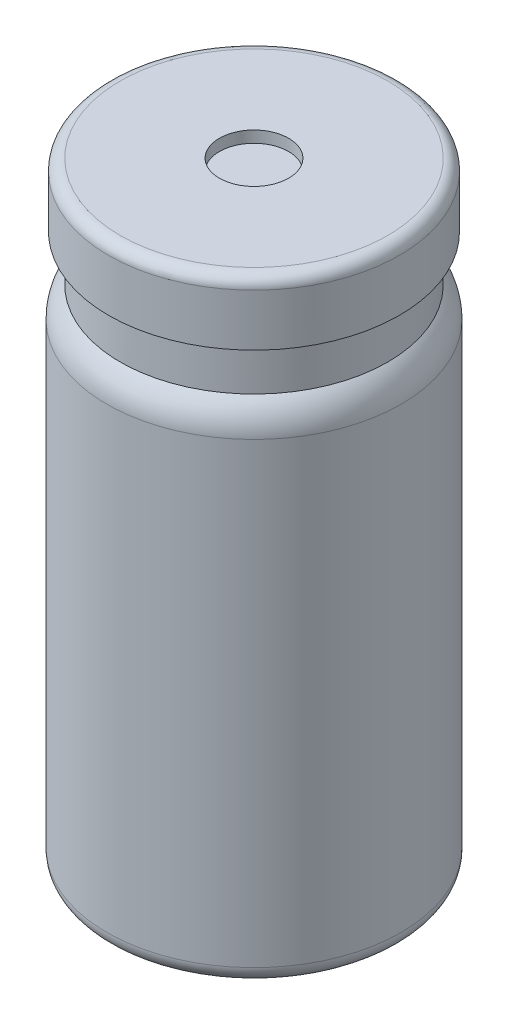
ISO-10303-21;
HEADER;
FILE_DESCRIPTION(('STEP AP214'),'2;1');
FILE_NAME('part.step','',(''),(''),'','','');
FILE_SCHEMA(('AUTOMOTIVE_DESIGN { 1 0 10303 214 1 1 1 1 }'));
ENDSEC;
DATA;
#1=APPLICATION_CONTEXT('core data for automotive mechanical design processes');
#2=APPLICATION_PROTOCOL_DEFINITION('international standard','automotive_design',2000,#1);
#3=PRODUCT_CONTEXT('',#1,'mechanical');
#4=PRODUCT('Part','Part','',(#3));
#5=PRODUCT_RELATED_PRODUCT_CATEGORY('part','',(#4));
#6=PRODUCT_DEFINITION_FORMATION('','',#4);
#7=PRODUCT_DEFINITION_CONTEXT('part definition',#1,'design');
#8=PRODUCT_DEFINITION('design','',#6,#7);
#9=PRODUCT_DEFINITION_SHAPE('','',#8);
#10=(LENGTH_UNIT() NAMED_UNIT(*) SI_UNIT(.MILLI.,.METRE.));
#11=(NAMED_UNIT(*) PLANE_ANGLE_UNIT() SI_UNIT($,.RADIAN.));
#12=(NAMED_UNIT(*) SI_UNIT($,.STERADIAN.) SOLID_ANGLE_UNIT());
#13=UNCERTAINTY_MEASURE_WITH_UNIT(LENGTH_MEASURE(1.E-05),#10,'distance_accuracy_value','');
#14=(GEOMETRIC_REPRESENTATION_CONTEXT(3) GLOBAL_UNCERTAINTY_ASSIGNED_CONTEXT((#13)) GLOBAL_UNIT_ASSIGNED_CONTEXT((#10,
#11,#12)) REPRESENTATION_CONTEXT('',''));
#15=CARTESIAN_POINT('',(0.,0.,0.));
#16=DIRECTION('',(0.,0.,1.));
#17=DIRECTION('',(1.,0.,0.));
#18=AXIS2_PLACEMENT_3D('',#15,#16,#17);
#19=CARTESIAN_POINT('',(0.,51.23,0.));
#20=DIRECTION('',(0.,1.,0.));
#21=DIRECTION('',(-1.,0.,0.));
#22=AXIS2_PLACEMENT_3D('',#19,#20,#21);
#23=CYLINDRICAL_SURFACE('',#22,11.595);
#24=CARTESIAN_POINT('',(0.,43.73,0.));
#25=DIRECTION('',(0.,1.,0.));
#26=DIRECTION('',(-1.,0.,0.));
#27=AXIS2_PLACEMENT_3D('',#24,#25,#26);
#28=CIRCLE('',#27,11.595);
#29=CARTESIAN_POINT('',(-11.595,43.73,0.));
#30=VERTEX_POINT('',#29);
#31=EDGE_CURVE('E73',#30,#30,#28,.T.);
#32=ORIENTED_EDGE('',*,*,#31,.T.);
#33=EDGE_LOOP('',(#32));
#34=FACE_BOUND('',#33,.T.);
#35=CARTESIAN_POINT('',(0.,47.73,0.));
#36=DIRECTION('',(0.,1.,0.));
#37=DIRECTION('',(0.,0.,1.));
#38=AXIS2_PLACEMENT_3D('',#35,#36,#37);
#39=CIRCLE('',#38,11.595);
#40=CARTESIAN_POINT('',(0.,47.73,11.595));
#41=VERTEX_POINT('',#40);
#42=EDGE_CURVE('E89',#41,#41,#39,.T.);
#43=ORIENTED_EDGE('',*,*,#42,.F.);
#44=EDGE_LOOP('',(#43));
#45=FACE_BOUND('',#44,.T.);
#46=ADVANCED_FACE('F45',(#34,#45),#23,.T.);
#47=CARTESIAN_POINT('',(0.,0.,0.));
#48=DIRECTION('',(0.,-1.,0.));
#49=DIRECTION('',(1.,0.,0.));
#50=AXIS2_PLACEMENT_3D('',#47,#48,#49);
#51=PLANE('',#50);
#52=CARTESIAN_POINT('',(0.,0.,0.));
#53=DIRECTION('',(0.,-1.,0.));
#54=DIRECTION('',(1.,0.,0.));
#55=AXIS2_PLACEMENT_3D('',#52,#53,#54);
#56=CIRCLE('',#55,11.245);
#57=CARTESIAN_POINT('',(11.245,0.,0.));
#58=VERTEX_POINT('',#57);
#59=EDGE_CURVE('E58',#58,#58,#56,.T.);
#60=ORIENTED_EDGE('',*,*,#59,.T.);
#61=EDGE_LOOP('',(#60));
#62=FACE_BOUND('',#61,.T.);
#63=ADVANCED_FACE('F119',(#62),#51,.T.);
#64=CARTESIAN_POINT('',(0.,51.23,0.));
#65=DIRECTION('',(0.,1.,0.));
#66=DIRECTION('',(-1.,0.,0.));
#67=AXIS2_PLACEMENT_3D('',#64,#65,#66);
#68=CYLINDRICAL_SURFACE('',#67,12.745);
#69=CARTESIAN_POINT('',(0.,1.5,0.));
#70=DIRECTION('',(0.,-1.,0.));
#71=DIRECTION('',(1.,0.,0.));
#72=AXIS2_PLACEMENT_3D('',#69,#70,#71);
#73=CIRCLE('',#72,12.745);
#74=CARTESIAN_POINT('',(12.745,1.5,0.));
#75=VERTEX_POINT('',#74);
#76=EDGE_CURVE('E63',#75,#75,#73,.F.);
#77=ORIENTED_EDGE('',*,*,#76,.T.);
#78=EDGE_LOOP('',(#77));
#79=FACE_BOUND('',#78,.T.);
#80=CARTESIAN_POINT('',(0.,41.1362575301314,0.));
#81=DIRECTION('',(0.,1.,0.));
#82=DIRECTION('',(-1.,0.,0.));
#83=AXIS2_PLACEMENT_3D('',#80,#81,#82);
#84=CIRCLE('',#83,12.745);
#85=CARTESIAN_POINT('',(-12.745,41.1362575301314,0.));
#86=VERTEX_POINT('',#85);
#87=EDGE_CURVE('E69',#86,#86,#84,.F.);
#88=ORIENTED_EDGE('',*,*,#87,.T.);
#89=EDGE_LOOP('',(#88));
#90=FACE_BOUND('',#89,.T.);
#91=ADVANCED_FACE('F127',(#79,#90),#68,.T.);
#92=CARTESIAN_POINT('',(0.,41.1362575301314,0.));
#93=DIRECTION('',(0.,1.,0.));
#94=DIRECTION('',(-1.,0.,0.));
#95=AXIS2_PLACEMENT_3D('',#92,#93,#94);
#96=TOROIDAL_SURFACE('',#95,9.24499999999999,3.5);
#97=ORIENTED_EDGE('',*,*,#87,.F.);
#98=EDGE_LOOP('',(#97));
#99=FACE_BOUND('',#98,.T.);
#100=ORIENTED_EDGE('',*,*,#31,.F.);
#101=EDGE_LOOP('',(#100));
#102=FACE_BOUND('',#101,.T.);
#103=ADVANCED_FACE('F134',(#99,#102),#96,.T.);
#104=CARTESIAN_POINT('',(0.,1.5,0.));
#105=DIRECTION('',(0.,-1.,0.));
#106=DIRECTION('',(1.,0.,0.));
#107=AXIS2_PLACEMENT_3D('',#104,#105,#106);
#108=TOROIDAL_SURFACE('',#107,11.245,1.5);
#109=ORIENTED_EDGE('',*,*,#59,.F.);
#110=EDGE_LOOP('',(#109));
#111=FACE_BOUND('',#110,.T.);
#112=ORIENTED_EDGE('',*,*,#76,.F.);
#113=EDGE_LOOP('',(#112));
#114=FACE_BOUND('',#113,.T.);
#115=ADVANCED_FACE('F138',(#111,#114),#108,.T.);
#116=CARTESIAN_POINT('',(0.,51.23,0.));
#117=DIRECTION('',(0.,1.,0.));
#118=DIRECTION('',(0.,0.,1.));
#119=AXIS2_PLACEMENT_3D('',#116,#117,#118);
#120=CYLINDRICAL_SURFACE('',#119,3.);
#121=CARTESIAN_POINT('',(0.,52.23,0.));
#122=DIRECTION('',(0.,1.,0.));
#123=DIRECTION('',(0.,0.,1.));
#124=AXIS2_PLACEMENT_3D('',#121,#122,#123);
#125=CIRCLE('',#124,3.);
#126=CARTESIAN_POINT('',(0.,52.23,3.));
#127=VERTEX_POINT('',#126);
#128=EDGE_CURVE('E81',#127,#127,#125,.T.);
#129=ORIENTED_EDGE('',*,*,#128,.F.);
#130=EDGE_LOOP('',(#129));
#131=FACE_BOUND('',#130,.T.);
#132=CARTESIAN_POINT('',(0.,53.23,0.));
#133=DIRECTION('',(0.,1.,0.));
#134=DIRECTION('',(0.,0.,1.));
#135=AXIS2_PLACEMENT_3D('',#132,#133,#134);
#136=CIRCLE('',#135,3.);
#137=CARTESIAN_POINT('',(0.,53.23,3.));
#138=VERTEX_POINT('',#137);
#139=EDGE_CURVE('E97',#138,#138,#136,.T.);
#140=ORIENTED_EDGE('',*,*,#139,.T.);
#141=EDGE_LOOP('',(#140));
#142=FACE_BOUND('',#141,.T.);
#143=ADVANCED_FACE('F102',(#131,#142),#120,.F.);
#144=CARTESIAN_POINT('',(0.,52.23,-3.));
#145=DIRECTION('',(0.,1.,0.));
#146=DIRECTION('',(0.,0.,1.));
#147=AXIS2_PLACEMENT_3D('',#144,#145,#146);
#148=PLANE('',#147);
#149=CARTESIAN_POINT('',(0.,52.23,0.));
#150=DIRECTION('',(0.,1.,0.));
#151=DIRECTION('',(0.,0.,1.));
#152=AXIS2_PLACEMENT_3D('',#149,#150,#151);
#153=CIRCLE('',#152,11.595);
#154=CARTESIAN_POINT('',(0.,52.23,11.595));
#155=VERTEX_POINT('',#154);
#156=EDGE_CURVE('E85',#155,#155,#153,.T.);
#157=ORIENTED_EDGE('',*,*,#156,.F.);
#158=EDGE_LOOP('',(#157));
#159=FACE_BOUND('',#158,.T.);
#160=ORIENTED_EDGE('',*,*,#128,.T.);
#161=EDGE_LOOP('',(#160));
#162=FACE_BOUND('',#161,.T.);
#163=ADVANCED_FACE('F143',(#159,#162),#148,.F.);
#164=CARTESIAN_POINT('',(0.,51.23,0.));
#165=DIRECTION('',(0.,1.,0.));
#166=DIRECTION('',(0.,0.,1.));
#167=AXIS2_PLACEMENT_3D('',#164,#165,#166);
#168=CYLINDRICAL_SURFACE('',#167,11.595);
#169=CARTESIAN_POINT('',(0.,51.23,0.));
#170=DIRECTION('',(0.,1.,0.));
#171=DIRECTION('',(-1.,0.,0.));
#172=AXIS2_PLACEMENT_3D('',#169,#170,#171);
#173=CIRCLE('',#172,11.595);
#174=CARTESIAN_POINT('',(-11.595,51.23,0.));
#175=VERTEX_POINT('',#174);
#176=EDGE_CURVE('E77',#175,#175,#173,.T.);
#177=ORIENTED_EDGE('',*,*,#176,.F.);
#178=EDGE_LOOP('',(#177));
#179=FACE_BOUND('',#178,.T.);
#180=ORIENTED_EDGE('',*,*,#156,.T.);
#181=EDGE_LOOP('',(#180));
#182=FACE_BOUND('',#181,.T.);
#183=ADVANCED_FACE('F155',(#179,#182),#168,.F.);
#184=CARTESIAN_POINT('',(0.,47.73,-11.595));
#185=DIRECTION('',(0.,1.,0.));
#186=DIRECTION('',(0.,0.,1.));
#187=AXIS2_PLACEMENT_3D('',#184,#185,#186);
#188=PLANE('',#187);
#189=CARTESIAN_POINT('',(0.,47.73,0.));
#190=DIRECTION('',(0.,1.,0.));
#191=DIRECTION('',(0.,0.,1.));
#192=AXIS2_PLACEMENT_3D('',#189,#190,#191);
#193=CIRCLE('',#192,12.595);
#194=CARTESIAN_POINT('',(0.,47.73,12.595));
#195=VERTEX_POINT('',#194);
#196=EDGE_CURVE('E93',#195,#195,#193,.T.);
#197=ORIENTED_EDGE('',*,*,#196,.F.);
#198=EDGE_LOOP('',(#197));
#199=FACE_BOUND('',#198,.T.);
#200=ORIENTED_EDGE('',*,*,#42,.T.);
#201=EDGE_LOOP('',(#200));
#202=FACE_BOUND('',#201,.T.);
#203=ADVANCED_FACE('F116',(#199,#202),#188,.F.);
#204=CARTESIAN_POINT('',(0.,51.23,0.));
#205=DIRECTION('',(0.,1.,0.));
#206=DIRECTION('',(0.,0.,1.));
#207=AXIS2_PLACEMENT_3D('',#204,#205,#206);
#208=CYLINDRICAL_SURFACE('',#207,12.595);
#209=CARTESIAN_POINT('',(0.,52.23,0.));
#210=DIRECTION('',(0.,-1.,0.));
#211=DIRECTION('',(0.,0.,-1.));
#212=AXIS2_PLACEMENT_3D('',#209,#210,#211);
#213=CIRCLE('',#212,12.595);
#214=CARTESIAN_POINT('',(0.,52.23,-12.595));
#215=VERTEX_POINT('',#214);
#216=EDGE_CURVE('E10',#215,#215,#213,.T.);
#217=ORIENTED_EDGE('',*,*,#216,.T.);
#218=EDGE_LOOP('',(#217));
#219=FACE_BOUND('',#218,.T.);
#220=ORIENTED_EDGE('',*,*,#196,.T.);
#221=EDGE_LOOP('',(#220));
#222=FACE_BOUND('',#221,.T.);
#223=ADVANCED_FACE('F107',(#219,#222),#208,.T.);
#224=CARTESIAN_POINT('',(0.,53.23,-3.));
#225=DIRECTION('',(0.,-1.,0.));
#226=DIRECTION('',(0.,0.,-1.));
#227=AXIS2_PLACEMENT_3D('',#224,#225,#226);
#228=PLANE('',#227);
#229=CARTESIAN_POINT('',(0.,53.23,0.));
#230=DIRECTION('',(0.,-1.,0.));
#231=DIRECTION('',(0.,0.,-1.));
#232=AXIS2_PLACEMENT_3D('',#229,#230,#231);
#233=CIRCLE('',#232,11.595);
#234=CARTESIAN_POINT('',(0.,53.23,-11.595));
#235=VERTEX_POINT('',#234);
#236=EDGE_CURVE('E53',#235,#235,#233,.F.);
#237=ORIENTED_EDGE('',*,*,#236,.T.);
#238=EDGE_LOOP('',(#237));
#239=FACE_BOUND('',#238,.T.);
#240=ORIENTED_EDGE('',*,*,#139,.F.);
#241=EDGE_LOOP('',(#240));
#242=FACE_BOUND('',#241,.T.);
#243=ADVANCED_FACE('F104',(#239,#242),#228,.F.);
#244=CARTESIAN_POINT('',(-11.595,51.23,0.));
#245=DIRECTION('',(0.,1.,0.));
#246=DIRECTION('',(-1.,0.,0.));
#247=AXIS2_PLACEMENT_3D('',#244,#245,#246);
#248=PLANE('',#247);
#249=ORIENTED_EDGE('',*,*,#176,.T.);
#250=EDGE_LOOP('',(#249));
#251=FACE_BOUND('',#250,.T.);
#252=ADVANCED_FACE('F106',(#251),#248,.T.);
#253=CARTESIAN_POINT('',(0.,52.23,0.));
#254=DIRECTION('',(0.,-1.,0.));
#255=DIRECTION('',(0.,0.,-1.));
#256=AXIS2_PLACEMENT_3D('',#253,#254,#255);
#257=TOROIDAL_SURFACE('',#256,11.595,1.);
#258=ORIENTED_EDGE('',*,*,#216,.F.);
#259=EDGE_LOOP('',(#258));
#260=FACE_BOUND('',#259,.T.);
#261=ORIENTED_EDGE('',*,*,#236,.F.);
#262=EDGE_LOOP('',(#261));
#263=FACE_BOUND('',#262,.T.);
#264=ADVANCED_FACE('F47',(#260,#263),#257,.T.);
#265=CLOSED_SHELL('',(#46,#63,#91,#103,#115,#143,#163,#183,#203,#223,#243,#252,#264));
#266=MANIFOLD_SOLID_BREP('B2',#265);
#267=ADVANCED_BREP_SHAPE_REPRESENTATION('',(#18,#266),#14);
#268=SHAPE_DEFINITION_REPRESENTATION(#9,#267);
ENDSEC;
END-ISO-10303-21;
